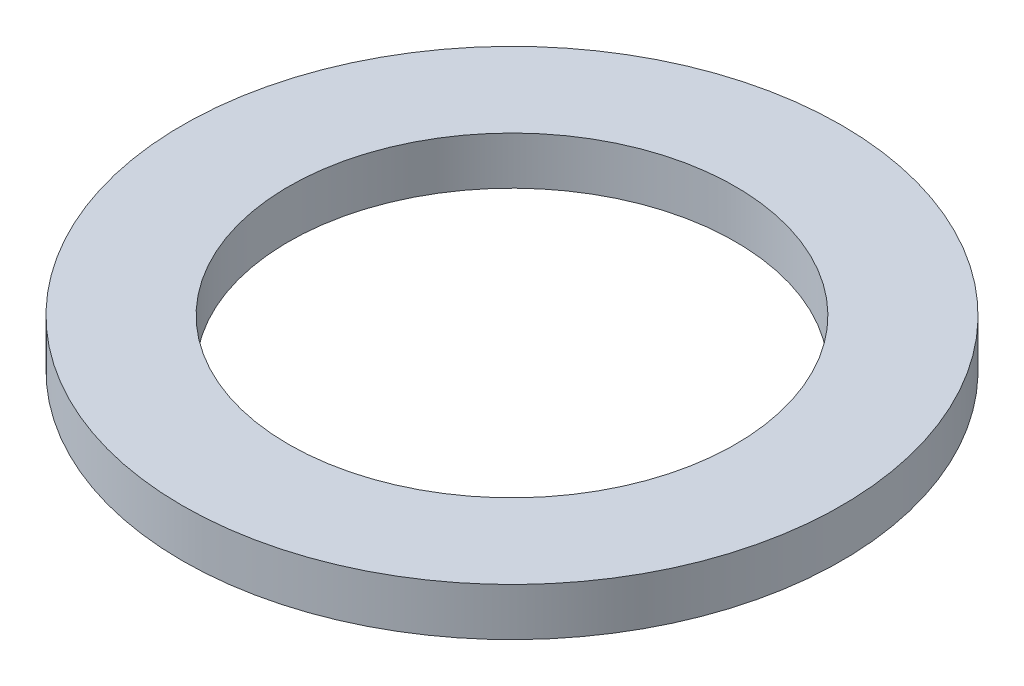
ISO-10303-21;
HEADER;
FILE_DESCRIPTION(('STEP AP214'),'2;1');
FILE_NAME('part.step','',(''),(''),'','','');
FILE_SCHEMA(('AUTOMOTIVE_DESIGN { 1 0 10303 214 1 1 1 1 }'));
ENDSEC;
DATA;
#1=APPLICATION_CONTEXT('core data for automotive mechanical design processes');
#2=APPLICATION_PROTOCOL_DEFINITION('international standard','automotive_design',2000,#1);
#3=PRODUCT_CONTEXT('',#1,'mechanical');
#4=PRODUCT('Part','Part','',(#3));
#5=PRODUCT_RELATED_PRODUCT_CATEGORY('part','',(#4));
#6=PRODUCT_DEFINITION_FORMATION('','',#4);
#7=PRODUCT_DEFINITION_CONTEXT('part definition',#1,'design');
#8=PRODUCT_DEFINITION('design','',#6,#7);
#9=PRODUCT_DEFINITION_SHAPE('','',#8);
#10=(LENGTH_UNIT() NAMED_UNIT(*) SI_UNIT(.MILLI.,.METRE.));
#11=(NAMED_UNIT(*) PLANE_ANGLE_UNIT() SI_UNIT($,.RADIAN.));
#12=(NAMED_UNIT(*) SI_UNIT($,.STERADIAN.) SOLID_ANGLE_UNIT());
#13=UNCERTAINTY_MEASURE_WITH_UNIT(LENGTH_MEASURE(1.E-05),#10,'distance_accuracy_value','');
#14=(GEOMETRIC_REPRESENTATION_CONTEXT(3) GLOBAL_UNCERTAINTY_ASSIGNED_CONTEXT((#13)) GLOBAL_UNIT_ASSIGNED_CONTEXT((#10,
#11,#12)) REPRESENTATION_CONTEXT('',''));
#15=CARTESIAN_POINT('',(0.,0.,0.));
#16=DIRECTION('',(0.,0.,1.));
#17=DIRECTION('',(1.,0.,0.));
#18=AXIS2_PLACEMENT_3D('',#15,#16,#17);
#19=CARTESIAN_POINT('',(0.,1.3716,0.));
#20=DIRECTION('',(0.,-1.,0.));
#21=DIRECTION('',(0.,0.,-1.));
#22=AXIS2_PLACEMENT_3D('',#19,#20,#21);
#23=CYLINDRICAL_SURFACE('',#22,9.4615);
#24=CARTESIAN_POINT('',(0.,1.3716,0.));
#25=DIRECTION('',(0.,1.,0.));
#26=DIRECTION('',(0.,0.,1.));
#27=AXIS2_PLACEMENT_3D('',#24,#25,#26);
#28=CIRCLE('',#27,9.4615);
#29=CARTESIAN_POINT('',(0.,1.3716,9.4615));
#30=VERTEX_POINT('',#29);
#31=EDGE_CURVE('E10',#30,#30,#28,.T.);
#32=ORIENTED_EDGE('',*,*,#31,.F.);
#33=EDGE_LOOP('',(#32));
#34=FACE_BOUND('',#33,.T.);
#35=CARTESIAN_POINT('',(0.,0.,0.));
#36=DIRECTION('',(0.,1.,0.));
#37=DIRECTION('',(0.,0.,1.));
#38=AXIS2_PLACEMENT_3D('',#35,#36,#37);
#39=CIRCLE('',#38,9.4615);
#40=CARTESIAN_POINT('',(0.,0.,9.4615));
#41=VERTEX_POINT('',#40);
#42=EDGE_CURVE('E35',#41,#41,#39,.T.);
#43=ORIENTED_EDGE('',*,*,#42,.T.);
#44=EDGE_LOOP('',(#43));
#45=FACE_BOUND('',#44,.T.);
#46=ADVANCED_FACE('F32',(#34,#45),#23,.T.);
#47=CARTESIAN_POINT('',(0.,1.3716,0.));
#48=DIRECTION('',(0.,1.,0.));
#49=DIRECTION('',(0.,0.,1.));
#50=AXIS2_PLACEMENT_3D('',#47,#48,#49);
#51=PLANE('',#50);
#52=CARTESIAN_POINT('',(0.,1.3716,0.));
#53=DIRECTION('',(0.,1.,0.));
#54=DIRECTION('',(0.,0.,1.));
#55=AXIS2_PLACEMENT_3D('',#52,#53,#54);
#56=CIRCLE('',#55,6.4135);
#57=CARTESIAN_POINT('',(0.,1.3716,6.4135));
#58=VERTEX_POINT('',#57);
#59=EDGE_CURVE('E44',#58,#58,#56,.T.);
#60=ORIENTED_EDGE('',*,*,#59,.F.);
#61=EDGE_LOOP('',(#60));
#62=FACE_BOUND('',#61,.T.);
#63=ORIENTED_EDGE('',*,*,#31,.T.);
#64=EDGE_LOOP('',(#63));
#65=FACE_BOUND('',#64,.T.);
#66=ADVANCED_FACE('F59',(#62,#65),#51,.T.);
#67=CARTESIAN_POINT('',(0.,0.,0.));
#68=DIRECTION('',(0.,1.,0.));
#69=DIRECTION('',(0.,0.,1.));
#70=AXIS2_PLACEMENT_3D('',#67,#68,#69);
#71=PLANE('',#70);
#72=CARTESIAN_POINT('',(0.,0.,0.));
#73=DIRECTION('',(0.,1.,0.));
#74=DIRECTION('',(0.,0.,1.));
#75=AXIS2_PLACEMENT_3D('',#72,#73,#74);
#76=CIRCLE('',#75,6.4135);
#77=CARTESIAN_POINT('',(0.,0.,6.4135));
#78=VERTEX_POINT('',#77);
#79=EDGE_CURVE('E42',#78,#78,#76,.T.);
#80=ORIENTED_EDGE('',*,*,#79,.T.);
#81=EDGE_LOOP('',(#80));
#82=FACE_BOUND('',#81,.T.);
#83=ORIENTED_EDGE('',*,*,#42,.F.);
#84=EDGE_LOOP('',(#83));
#85=FACE_BOUND('',#84,.T.);
#86=ADVANCED_FACE('F50',(#82,#85),#71,.F.);
#87=CARTESIAN_POINT('',(0.,0.,0.));
#88=DIRECTION('',(0.,1.,0.));
#89=DIRECTION('',(0.,0.,1.));
#90=AXIS2_PLACEMENT_3D('',#87,#88,#89);
#91=CYLINDRICAL_SURFACE('',#90,6.4135);
#92=ORIENTED_EDGE('',*,*,#79,.F.);
#93=EDGE_LOOP('',(#92));
#94=FACE_BOUND('',#93,.T.);
#95=ORIENTED_EDGE('',*,*,#59,.T.);
#96=EDGE_LOOP('',(#95));
#97=FACE_BOUND('',#96,.T.);
#98=ADVANCED_FACE('F53',(#94,#97),#91,.F.);
#99=CLOSED_SHELL('',(#46,#66,#86,#98));
#100=MANIFOLD_SOLID_BREP('B2',#99);
#101=ADVANCED_BREP_SHAPE_REPRESENTATION('',(#18,#100),#14);
#102=SHAPE_DEFINITION_REPRESENTATION(#9,#101);
ENDSEC;
END-ISO-10303-21;
